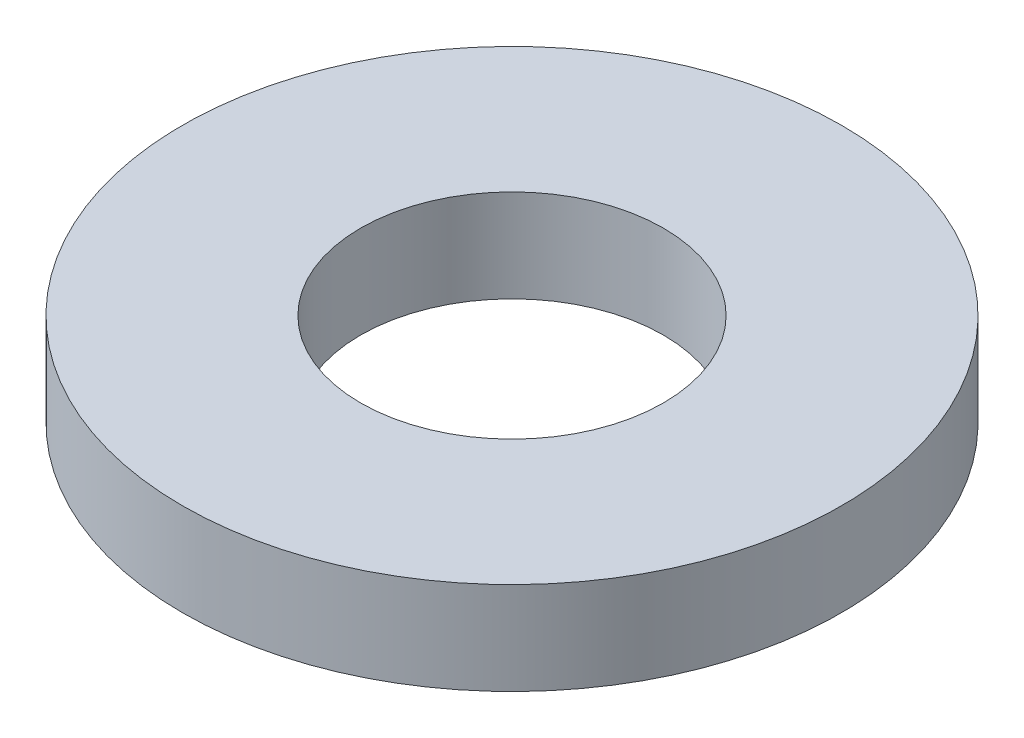
ISO-10303-21;
HEADER;
FILE_DESCRIPTION(('STEP AP214'),'2;1');
FILE_NAME('part.step','',(''),(''),'','','');
FILE_SCHEMA(('AUTOMOTIVE_DESIGN { 1 0 10303 214 1 1 1 1 }'));
ENDSEC;
DATA;
#1=APPLICATION_CONTEXT('core data for automotive mechanical design processes');
#2=APPLICATION_PROTOCOL_DEFINITION('international standard','automotive_design',2000,#1);
#3=PRODUCT_CONTEXT('',#1,'mechanical');
#4=PRODUCT('Part','Part','',(#3));
#5=PRODUCT_RELATED_PRODUCT_CATEGORY('part','',(#4));
#6=PRODUCT_DEFINITION_FORMATION('','',#4);
#7=PRODUCT_DEFINITION_CONTEXT('part definition',#1,'design');
#8=PRODUCT_DEFINITION('design','',#6,#7);
#9=PRODUCT_DEFINITION_SHAPE('','',#8);
#10=(LENGTH_UNIT() NAMED_UNIT(*) SI_UNIT(.MILLI.,.METRE.));
#11=(NAMED_UNIT(*) PLANE_ANGLE_UNIT() SI_UNIT($,.RADIAN.));
#12=(NAMED_UNIT(*) SI_UNIT($,.STERADIAN.) SOLID_ANGLE_UNIT());
#13=UNCERTAINTY_MEASURE_WITH_UNIT(LENGTH_MEASURE(1.E-05),#10,'distance_accuracy_value','');
#14=(GEOMETRIC_REPRESENTATION_CONTEXT(3) GLOBAL_UNCERTAINTY_ASSIGNED_CONTEXT((#13)) GLOBAL_UNIT_ASSIGNED_CONTEXT((#10,
#11,#12)) REPRESENTATION_CONTEXT('',''));
#15=CARTESIAN_POINT('',(0.,0.,0.));
#16=DIRECTION('',(0.,0.,1.));
#17=DIRECTION('',(1.,0.,0.));
#18=AXIS2_PLACEMENT_3D('',#15,#16,#17);
#19=CARTESIAN_POINT('',(0.,26.,0.));
#20=DIRECTION('',(0.,-1.,0.));
#21=DIRECTION('',(0.,0.,-1.));
#22=AXIS2_PLACEMENT_3D('',#19,#20,#21);
#23=CYLINDRICAL_SURFACE('',#22,92.5);
#24=CARTESIAN_POINT('',(0.,26.,0.));
#25=DIRECTION('',(0.,1.,0.));
#26=DIRECTION('',(0.,0.,1.));
#27=AXIS2_PLACEMENT_3D('',#24,#25,#26);
#28=CIRCLE('',#27,92.5);
#29=CARTESIAN_POINT('',(0.,26.,-92.5));
#30=VERTEX_POINT('',#29);
#31=EDGE_CURVE('E10',#30,#30,#28,.T.);
#32=CARTESIAN_POINT('',(0.,0.,0.));
#33=DIRECTION('',(0.,1.,0.));
#34=DIRECTION('',(0.,0.,1.));
#35=AXIS2_PLACEMENT_3D('',#32,#33,#34);
#36=CIRCLE('',#35,92.5);
#37=CARTESIAN_POINT('',(0.,0.,-92.5));
#38=VERTEX_POINT('',#37);
#39=EDGE_CURVE('E37',#38,#38,#36,.T.);
#40=CARTESIAN_POINT('',(0.,26.,-92.5));
#41=CARTESIAN_POINT('',(0.,25.7291666666667,-92.5));
#42=CARTESIAN_POINT('',(0.,25.4583333333333,-92.5));
#43=CARTESIAN_POINT('',(0.,24.9166666666667,-92.5));
#44=CARTESIAN_POINT('',(0.,24.6458333333333,-92.5));
#45=CARTESIAN_POINT('',(0.,24.1041666666667,-92.5));
#46=CARTESIAN_POINT('',(0.,23.8333333333333,-92.5));
#47=CARTESIAN_POINT('',(0.,23.2916666666667,-92.5));
#48=CARTESIAN_POINT('',(0.,23.0208333333333,-92.5));
#49=CARTESIAN_POINT('',(0.,22.4791666666667,-92.5));
#50=CARTESIAN_POINT('',(0.,22.2083333333333,-92.5));
#51=CARTESIAN_POINT('',(0.,21.6666666666667,-92.5));
#52=CARTESIAN_POINT('',(0.,21.3958333333333,-92.5));
#53=CARTESIAN_POINT('',(0.,20.8541666666667,-92.5));
#54=CARTESIAN_POINT('',(0.,20.5833333333333,-92.5));
#55=CARTESIAN_POINT('',(0.,20.0416666666667,-92.5));
#56=CARTESIAN_POINT('',(0.,19.7708333333333,-92.5));
#57=CARTESIAN_POINT('',(0.,19.2291666666667,-92.5));
#58=CARTESIAN_POINT('',(0.,18.9583333333333,-92.5));
#59=CARTESIAN_POINT('',(0.,18.4166666666667,-92.5));
#60=CARTESIAN_POINT('',(0.,18.1458333333333,-92.5));
#61=CARTESIAN_POINT('',(0.,17.6041666666667,-92.5));
#62=CARTESIAN_POINT('',(0.,17.3333333333333,-92.5));
#63=CARTESIAN_POINT('',(0.,16.7916666666667,-92.5));
#64=CARTESIAN_POINT('',(0.,16.5208333333333,-92.5));
#65=CARTESIAN_POINT('',(0.,15.9791666666667,-92.5));
#66=CARTESIAN_POINT('',(0.,15.7083333333333,-92.5));
#67=CARTESIAN_POINT('',(0.,15.1666666666667,-92.5));
#68=CARTESIAN_POINT('',(0.,14.8958333333333,-92.5));
#69=CARTESIAN_POINT('',(0.,14.3541666666667,-92.5));
#70=CARTESIAN_POINT('',(0.,14.0833333333333,-92.5));
#71=CARTESIAN_POINT('',(0.,13.5416666666667,-92.5));
#72=CARTESIAN_POINT('',(0.,13.2708333333333,-92.5));
#73=CARTESIAN_POINT('',(0.,12.7291666666667,-92.5));
#74=CARTESIAN_POINT('',(0.,12.4583333333333,-92.5));
#75=CARTESIAN_POINT('',(0.,11.9166666666667,-92.5));
#76=CARTESIAN_POINT('',(0.,11.6458333333333,-92.5));
#77=CARTESIAN_POINT('',(0.,11.1041666666667,-92.5));
#78=CARTESIAN_POINT('',(0.,10.8333333333333,-92.5));
#79=CARTESIAN_POINT('',(0.,10.2916666666667,-92.5));
#80=CARTESIAN_POINT('',(0.,10.0208333333333,-92.5));
#81=CARTESIAN_POINT('',(0.,9.47916666666667,-92.5));
#82=CARTESIAN_POINT('',(0.,9.20833333333333,-92.5));
#83=CARTESIAN_POINT('',(0.,8.66666666666667,-92.5));
#84=CARTESIAN_POINT('',(0.,8.39583333333333,-92.5));
#85=CARTESIAN_POINT('',(0.,7.85416666666667,-92.5));
#86=CARTESIAN_POINT('',(0.,7.58333333333333,-92.5));
#87=CARTESIAN_POINT('',(0.,7.04166666666667,-92.5));
#88=CARTESIAN_POINT('',(0.,6.77083333333333,-92.5));
#89=CARTESIAN_POINT('',(0.,6.22916666666667,-92.5));
#90=CARTESIAN_POINT('',(0.,5.95833333333333,-92.5));
#91=CARTESIAN_POINT('',(0.,5.41666666666667,-92.5));
#92=CARTESIAN_POINT('',(0.,5.14583333333333,-92.5));
#93=CARTESIAN_POINT('',(0.,4.60416666666667,-92.5));
#94=CARTESIAN_POINT('',(0.,4.33333333333333,-92.5));
#95=CARTESIAN_POINT('',(0.,3.79166666666667,-92.5));
#96=CARTESIAN_POINT('',(0.,3.52083333333333,-92.5));
#97=CARTESIAN_POINT('',(0.,2.97916666666667,-92.5));
#98=CARTESIAN_POINT('',(0.,2.70833333333333,-92.5));
#99=CARTESIAN_POINT('',(0.,2.16666666666667,-92.5));
#100=CARTESIAN_POINT('',(0.,1.89583333333333,-92.5));
#101=CARTESIAN_POINT('',(0.,1.35416666666667,-92.5));
#102=CARTESIAN_POINT('',(0.,1.08333333333333,-92.5));
#103=CARTESIAN_POINT('',(0.,0.541666666666667,-92.5));
#104=CARTESIAN_POINT('',(0.,0.270833333333334,-92.5));
#105=CARTESIAN_POINT('',(0.,0.,-92.5));
#106=B_SPLINE_CURVE_WITH_KNOTS('',3,(#40,#41,#42,#43,#44,#45,#46,#47,#48,#49,#50,#51,#52,#53,
#54,#55,#56,#57,#58,#59,#60,#61,#62,#63,#64,#65,#66,#67,#68,#69,#70,#71,#72,#73,#74,#75,#76,#77,
#78,#79,#80,#81,#82,#83,#84,#85,#86,#87,#88,#89,#90,#91,#92,#93,#94,#95,#96,#97,#98,#99,#100,
#101,#102,#103,#104,#105),.UNSPECIFIED.,.F.,.F.,(4,2,2,2,2,2,2,2,2,2,2,2,2,2,2,2,2,2,2,2,2,2,2,
2,2,2,2,2,2,2,2,2,4),(0.,0.812500000000001,1.625,2.4375,3.25,4.0625,4.875,5.6875,6.5,7.3125,
8.125,8.9375,9.75,10.5625,11.375,12.1875,13.,13.8125,14.625,15.4375,16.25,17.0625,17.875,
18.6875,19.5,20.3125,21.125,21.9375,22.75,23.5625,24.375,25.1875,26.),.UNSPECIFIED.);
#107=EDGE_CURVE('BSEAM40',#30,#38,#106,.T.);
#108=ORIENTED_EDGE('',*,*,#31,.F.);
#109=ORIENTED_EDGE('',*,*,#39,.T.);
#110=ORIENTED_EDGE('',*,*,#107,.T.);
#111=ORIENTED_EDGE('',*,*,#107,.F.);
#112=EDGE_LOOP('',(#108,#110,#109,#111));
#113=FACE_BOUND('',#112,.T.);
#114=ADVANCED_FACE('F40',(#113),#23,.T.);
#115=CARTESIAN_POINT('',(0.,26.,0.));
#116=DIRECTION('',(0.,1.,0.));
#117=DIRECTION('',(0.,0.,1.));
#118=AXIS2_PLACEMENT_3D('',#115,#116,#117);
#119=PLANE('',#118);
#120=CARTESIAN_POINT('',(0.,26.,0.));
#121=DIRECTION('',(0.,1.,0.));
#122=DIRECTION('',(0.,0.,1.));
#123=AXIS2_PLACEMENT_3D('',#120,#121,#122);
#124=CIRCLE('',#123,42.5);
#125=CARTESIAN_POINT('',(0.,26.,-42.5));
#126=VERTEX_POINT('',#125);
#127=EDGE_CURVE('E50',#126,#126,#124,.T.);
#128=ORIENTED_EDGE('',*,*,#127,.F.);
#129=EDGE_LOOP('',(#128));
#130=FACE_BOUND('',#129,.T.);
#131=ORIENTED_EDGE('',*,*,#31,.T.);
#132=EDGE_LOOP('',(#131));
#133=FACE_BOUND('',#132,.T.);
#134=ADVANCED_FACE('F59',(#130,#133),#119,.T.);
#135=CARTESIAN_POINT('',(0.,0.,0.));
#136=DIRECTION('',(0.,1.,0.));
#137=DIRECTION('',(0.,0.,1.));
#138=AXIS2_PLACEMENT_3D('',#135,#136,#137);
#139=PLANE('',#138);
#140=CARTESIAN_POINT('',(0.,0.,0.));
#141=DIRECTION('',(0.,1.,0.));
#142=DIRECTION('',(0.,0.,1.));
#143=AXIS2_PLACEMENT_3D('',#140,#141,#142);
#144=CIRCLE('',#143,42.5);
#145=CARTESIAN_POINT('',(0.,0.,-42.5));
#146=VERTEX_POINT('',#145);
#147=EDGE_CURVE('E47',#146,#146,#144,.T.);
#148=ORIENTED_EDGE('',*,*,#147,.T.);
#149=EDGE_LOOP('',(#148));
#150=FACE_BOUND('',#149,.T.);
#151=ORIENTED_EDGE('',*,*,#39,.F.);
#152=EDGE_LOOP('',(#151));
#153=FACE_BOUND('',#152,.T.);
#154=ADVANCED_FACE('F58',(#150,#153),#139,.F.);
#155=CARTESIAN_POINT('',(0.,26.,0.));
#156=DIRECTION('',(0.,-1.,0.));
#157=DIRECTION('',(0.,0.,-1.));
#158=AXIS2_PLACEMENT_3D('',#155,#156,#157);
#159=CYLINDRICAL_SURFACE('',#158,42.5);
#160=CARTESIAN_POINT('',(0.,26.,-42.5));
#161=CARTESIAN_POINT('',(0.,25.7291666666667,-42.5));
#162=CARTESIAN_POINT('',(0.,25.4583333333333,-42.5));
#163=CARTESIAN_POINT('',(0.,24.9166666666667,-42.5));
#164=CARTESIAN_POINT('',(0.,24.6458333333333,-42.5));
#165=CARTESIAN_POINT('',(0.,24.1041666666667,-42.5));
#166=CARTESIAN_POINT('',(0.,23.8333333333333,-42.5));
#167=CARTESIAN_POINT('',(0.,23.2916666666667,-42.5));
#168=CARTESIAN_POINT('',(0.,23.0208333333333,-42.5));
#169=CARTESIAN_POINT('',(0.,22.4791666666667,-42.5));
#170=CARTESIAN_POINT('',(0.,22.2083333333333,-42.5));
#171=CARTESIAN_POINT('',(0.,21.6666666666667,-42.5));
#172=CARTESIAN_POINT('',(0.,21.3958333333333,-42.5));
#173=CARTESIAN_POINT('',(0.,20.8541666666667,-42.5));
#174=CARTESIAN_POINT('',(0.,20.5833333333333,-42.5));
#175=CARTESIAN_POINT('',(0.,20.0416666666667,-42.5));
#176=CARTESIAN_POINT('',(0.,19.7708333333333,-42.5));
#177=CARTESIAN_POINT('',(0.,19.2291666666667,-42.5));
#178=CARTESIAN_POINT('',(0.,18.9583333333333,-42.5));
#179=CARTESIAN_POINT('',(0.,18.4166666666667,-42.5));
#180=CARTESIAN_POINT('',(0.,18.1458333333333,-42.5));
#181=CARTESIAN_POINT('',(0.,17.6041666666667,-42.5));
#182=CARTESIAN_POINT('',(0.,17.3333333333333,-42.5));
#183=CARTESIAN_POINT('',(0.,16.7916666666667,-42.5));
#184=CARTESIAN_POINT('',(0.,16.5208333333333,-42.5));
#185=CARTESIAN_POINT('',(0.,15.9791666666667,-42.5));
#186=CARTESIAN_POINT('',(0.,15.7083333333333,-42.5));
#187=CARTESIAN_POINT('',(0.,15.1666666666667,-42.5));
#188=CARTESIAN_POINT('',(0.,14.8958333333333,-42.5));
#189=CARTESIAN_POINT('',(0.,14.3541666666667,-42.5));
#190=CARTESIAN_POINT('',(0.,14.0833333333333,-42.5));
#191=CARTESIAN_POINT('',(0.,13.5416666666667,-42.5));
#192=CARTESIAN_POINT('',(0.,13.2708333333333,-42.5));
#193=CARTESIAN_POINT('',(0.,12.7291666666667,-42.5));
#194=CARTESIAN_POINT('',(0.,12.4583333333333,-42.5));
#195=CARTESIAN_POINT('',(0.,11.9166666666667,-42.5));
#196=CARTESIAN_POINT('',(0.,11.6458333333333,-42.5));
#197=CARTESIAN_POINT('',(0.,11.1041666666667,-42.5));
#198=CARTESIAN_POINT('',(0.,10.8333333333333,-42.5));
#199=CARTESIAN_POINT('',(0.,10.2916666666667,-42.5));
#200=CARTESIAN_POINT('',(0.,10.0208333333333,-42.5));
#201=CARTESIAN_POINT('',(0.,9.47916666666667,-42.5));
#202=CARTESIAN_POINT('',(0.,9.20833333333333,-42.5));
#203=CARTESIAN_POINT('',(0.,8.66666666666667,-42.5));
#204=CARTESIAN_POINT('',(0.,8.39583333333333,-42.5));
#205=CARTESIAN_POINT('',(0.,7.85416666666667,-42.5));
#206=CARTESIAN_POINT('',(0.,7.58333333333333,-42.5));
#207=CARTESIAN_POINT('',(0.,7.04166666666667,-42.5));
#208=CARTESIAN_POINT('',(0.,6.77083333333333,-42.5));
#209=CARTESIAN_POINT('',(0.,6.22916666666667,-42.5));
#210=CARTESIAN_POINT('',(0.,5.95833333333333,-42.5));
#211=CARTESIAN_POINT('',(0.,5.41666666666667,-42.5));
#212=CARTESIAN_POINT('',(0.,5.14583333333333,-42.5));
#213=CARTESIAN_POINT('',(0.,4.60416666666667,-42.5));
#214=CARTESIAN_POINT('',(0.,4.33333333333333,-42.5));
#215=CARTESIAN_POINT('',(0.,3.79166666666667,-42.5));
#216=CARTESIAN_POINT('',(0.,3.52083333333333,-42.5));
#217=CARTESIAN_POINT('',(0.,2.97916666666667,-42.5));
#218=CARTESIAN_POINT('',(0.,2.70833333333333,-42.5));
#219=CARTESIAN_POINT('',(0.,2.16666666666667,-42.5));
#220=CARTESIAN_POINT('',(0.,1.89583333333333,-42.5));
#221=CARTESIAN_POINT('',(0.,1.35416666666667,-42.5));
#222=CARTESIAN_POINT('',(0.,1.08333333333333,-42.5));
#223=CARTESIAN_POINT('',(0.,0.541666666666667,-42.5));
#224=CARTESIAN_POINT('',(0.,0.270833333333334,-42.5));
#225=CARTESIAN_POINT('',(0.,0.,-42.5));
#226=B_SPLINE_CURVE_WITH_KNOTS('',3,(#160,#161,#162,#163,#164,#165,#166,#167,#168,#169,#170,
#171,#172,#173,#174,#175,#176,#177,#178,#179,#180,#181,#182,#183,#184,#185,#186,#187,#188,#189,
#190,#191,#192,#193,#194,#195,#196,#197,#198,#199,#200,#201,#202,#203,#204,#205,#206,#207,#208,
#209,#210,#211,#212,#213,#214,#215,#216,#217,#218,#219,#220,#221,#222,#223,#224,#225),
.UNSPECIFIED.,.F.,.F.,(4,2,2,2,2,2,2,2,2,2,2,2,2,2,2,2,2,2,2,2,2,2,2,2,2,2,2,2,2,2,2,2,4),(0.,
0.812499999999997,1.625,2.4375,3.25,4.0625,4.875,5.6875,6.5,7.3125,8.125,8.93749999999999,
9.74999999999999,10.5625,11.375,12.1875,13.,13.8125,14.625,15.4375,16.25,17.0625,17.875,18.6875,
19.5,20.3125,21.125,21.9375,22.75,23.5625,24.375,25.1875,26.),.UNSPECIFIED.);
#227=EDGE_CURVE('BSEAM54',#126,#146,#226,.T.);
#228=ORIENTED_EDGE('',*,*,#127,.T.);
#229=ORIENTED_EDGE('',*,*,#147,.F.);
#230=ORIENTED_EDGE('',*,*,#227,.T.);
#231=ORIENTED_EDGE('',*,*,#227,.F.);
#232=EDGE_LOOP('',(#228,#230,#229,#231));
#233=FACE_BOUND('',#232,.T.);
#234=ADVANCED_FACE('F54',(#233),#159,.F.);
#235=CLOSED_SHELL('',(#114,#134,#154,#234));
#236=MANIFOLD_SOLID_BREP('B2',#235);
#237=ADVANCED_BREP_SHAPE_REPRESENTATION('',(#18,#236),#14);
#238=SHAPE_DEFINITION_REPRESENTATION(#9,#237);
ENDSEC;
END-ISO-10303-21;
